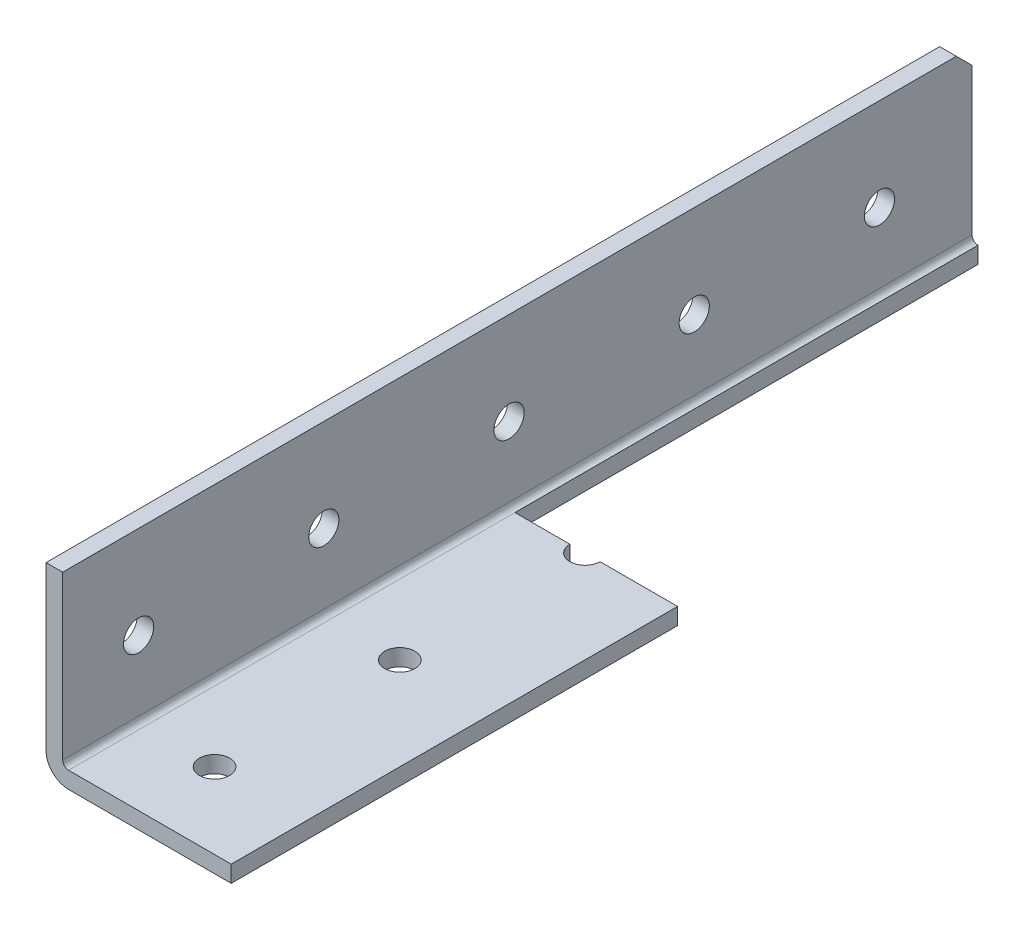
ISO-10303-21;
HEADER;
FILE_DESCRIPTION(('STEP AP214'),'2;1');
FILE_NAME('part.step','',(''),(''),'','','');
FILE_SCHEMA(('AUTOMOTIVE_DESIGN { 1 0 10303 214 1 1 1 1 }'));
ENDSEC;
DATA;
#1=APPLICATION_CONTEXT('core data for automotive mechanical design processes');
#2=APPLICATION_PROTOCOL_DEFINITION('international standard','automotive_design',2000,#1);
#3=PRODUCT_CONTEXT('',#1,'mechanical');
#4=PRODUCT('Part','Part','',(#3));
#5=PRODUCT_RELATED_PRODUCT_CATEGORY('part','',(#4));
#6=PRODUCT_DEFINITION_FORMATION('','',#4);
#7=PRODUCT_DEFINITION_CONTEXT('part definition',#1,'design');
#8=PRODUCT_DEFINITION('design','',#6,#7);
#9=PRODUCT_DEFINITION_SHAPE('','',#8);
#10=(LENGTH_UNIT() NAMED_UNIT(*) SI_UNIT(.MILLI.,.METRE.));
#11=(NAMED_UNIT(*) PLANE_ANGLE_UNIT() SI_UNIT($,.RADIAN.));
#12=(NAMED_UNIT(*) SI_UNIT($,.STERADIAN.) SOLID_ANGLE_UNIT());
#13=UNCERTAINTY_MEASURE_WITH_UNIT(LENGTH_MEASURE(1.E-05),#10,'distance_accuracy_value','');
#14=(GEOMETRIC_REPRESENTATION_CONTEXT(3) GLOBAL_UNCERTAINTY_ASSIGNED_CONTEXT((#13)) GLOBAL_UNIT_ASSIGNED_CONTEXT((#10,
#11,#12)) REPRESENTATION_CONTEXT('',''));
#15=CARTESIAN_POINT('',(0.,0.,0.));
#16=DIRECTION('',(0.,0.,1.));
#17=DIRECTION('',(1.,0.,0.));
#18=AXIS2_PLACEMENT_3D('',#15,#16,#17);
#19=CARTESIAN_POINT('',(25.4,0.,-749.3));
#20=DIRECTION('',(0.,-1.,0.));
#21=DIRECTION('',(0.,0.,-1.));
#22=AXIS2_PLACEMENT_3D('',#19,#20,#21);
#23=PLANE('',#22);
#24=DIRECTION('',(-1.,0.,0.));
#25=VECTOR('',#24,1.);
#26=CARTESIAN_POINT('',(25.4,0.,-685.8));
#27=LINE('',#26,#25);
#28=CARTESIAN_POINT('',(25.4,0.,-685.8));
#29=VERTEX_POINT('',#28);
#30=CARTESIAN_POINT('',(14.7701,0.,-685.8));
#31=VERTEX_POINT('',#30);
#32=EDGE_CURVE('E49',#29,#31,#27,.T.);
#33=ORIENTED_EDGE('',*,*,#32,.F.);
#34=DIRECTION('',(0.,0.,1.));
#35=VECTOR('',#34,1.);
#36=CARTESIAN_POINT('',(25.4,0.,-749.3));
#37=LINE('',#36,#35);
#38=CARTESIAN_POINT('',(25.4,0.,-624.586));
#39=VERTEX_POINT('',#38);
#40=EDGE_CURVE('E185',#29,#39,#37,.T.);
#41=ORIENTED_EDGE('',*,*,#40,.T.);
#42=DIRECTION('',(1.,0.,0.));
#43=VECTOR('',#42,1.);
#44=CARTESIAN_POINT('',(25.4,0.,-624.586));
#45=LINE('',#44,#43);
#46=CARTESIAN_POINT('',(3.0988,0.,-624.586));
#47=VERTEX_POINT('',#46);
#48=EDGE_CURVE('E194',#47,#39,#45,.T.);
#49=ORIENTED_EDGE('',*,*,#48,.F.);
#50=DIRECTION('',(0.,0.,1.));
#51=VECTOR('',#50,1.);
#52=CARTESIAN_POINT('',(3.0988,0.,-749.3));
#53=LINE('',#52,#51);
#54=CARTESIAN_POINT('',(3.0988,0.,-685.8));
#55=VERTEX_POINT('',#54);
#56=EDGE_CURVE('E167',#47,#55,#53,.F.);
#57=ORIENTED_EDGE('',*,*,#56,.T.);
#58=CARTESIAN_POINT('',(10.6299000000001,0.,-685.8));
#59=VERTEX_POINT('',#58);
#60=EDGE_CURVE('E137',#59,#55,#27,.T.);
#61=ORIENTED_EDGE('',*,*,#60,.F.);
#62=CARTESIAN_POINT('',(12.7,0.,-685.8));
#63=DIRECTION('',(0.,-1.,0.));
#64=DIRECTION('',(0.,0.,-1.));
#65=AXIS2_PLACEMENT_3D('',#62,#63,#64);
#66=CIRCLE('',#65,2.07009999999995);
#67=EDGE_CURVE('E243',#31,#59,#66,.T.);
#68=ORIENTED_EDGE('',*,*,#67,.F.);
#69=EDGE_LOOP('',(#33,#41,#49,#57,#61,#68));
#70=FACE_BOUND('',#69,.T.);
#71=CARTESIAN_POINT('',(12.7,0.,-660.4));
#72=DIRECTION('',(0.,-1.,0.));
#73=DIRECTION('',(0.,0.,-1.));
#74=AXIS2_PLACEMENT_3D('',#71,#72,#73);
#75=CIRCLE('',#74,2.07009999999995);
#76=CARTESIAN_POINT('',(12.7,0.,-662.4701));
#77=VERTEX_POINT('',#76);
#78=EDGE_CURVE('E247',#77,#77,#75,.T.);
#79=ORIENTED_EDGE('',*,*,#78,.F.);
#80=EDGE_LOOP('',(#79));
#81=FACE_BOUND('',#80,.T.);
#82=CARTESIAN_POINT('',(12.7,0.,-635.));
#83=DIRECTION('',(0.,-1.,0.));
#84=DIRECTION('',(0.,0.,-1.));
#85=AXIS2_PLACEMENT_3D('',#82,#83,#84);
#86=CIRCLE('',#85,2.07009999999995);
#87=CARTESIAN_POINT('',(12.7,0.,-637.0701));
#88=VERTEX_POINT('',#87);
#89=EDGE_CURVE('E253',#88,#88,#86,.T.);
#90=ORIENTED_EDGE('',*,*,#89,.F.);
#91=EDGE_LOOP('',(#90));
#92=FACE_BOUND('',#91,.T.);
#93=ADVANCED_FACE('F34',(#70,#81,#92),#23,.T.);
#94=CARTESIAN_POINT('',(25.4,25.4,-749.3));
#95=DIRECTION('',(0.,0.,-1.));
#96=DIRECTION('',(-1.,0.,0.));
#97=AXIS2_PLACEMENT_3D('',#94,#95,#96);
#98=PLANE('',#97);
#99=DIRECTION('',(0.,1.,0.));
#100=VECTOR('',#99,1.);
#101=CARTESIAN_POINT('',(3.0988,25.4,-749.3));
#102=LINE('',#101,#100);
#103=CARTESIAN_POINT('',(3.0988,0.,-749.3));
#104=VERTEX_POINT('',#103);
#105=CARTESIAN_POINT('',(3.0988,2.286,-749.3));
#106=VERTEX_POINT('',#105);
#107=EDGE_CURVE('E123',#104,#106,#102,.T.);
#108=ORIENTED_EDGE('',*,*,#107,.F.);
#109=CARTESIAN_POINT('',(3.0988,3.0988,-749.3));
#110=DIRECTION('',(0.,0.,-1.));
#111=DIRECTION('',(-1.,0.,0.));
#112=AXIS2_PLACEMENT_3D('',#109,#110,#111);
#113=CIRCLE('',#112,3.0988);
#114=CARTESIAN_POINT('',(0.,3.0988,-749.3));
#115=VERTEX_POINT('',#114);
#116=EDGE_CURVE('E42',#104,#115,#113,.T.);
#117=ORIENTED_EDGE('',*,*,#116,.T.);
#118=DIRECTION('',(0.,-1.,0.));
#119=VECTOR('',#118,1.);
#120=CARTESIAN_POINT('',(0.,25.4,-749.3));
#121=LINE('',#120,#119);
#122=CARTESIAN_POINT('',(0.,23.241,-749.3));
#123=VERTEX_POINT('',#122);
#124=EDGE_CURVE('E175',#123,#115,#121,.T.);
#125=ORIENTED_EDGE('',*,*,#124,.F.);
#126=DIRECTION('',(1.,0.,0.));
#127=VECTOR('',#126,1.);
#128=CARTESIAN_POINT('',(25.4,23.241,-749.3));
#129=LINE('',#128,#127);
#130=CARTESIAN_POINT('',(2.286,23.241,-749.3));
#131=VERTEX_POINT('',#130);
#132=EDGE_CURVE('E266',#123,#131,#129,.T.);
#133=ORIENTED_EDGE('',*,*,#132,.T.);
#134=DIRECTION('',(0.,1.,0.));
#135=VECTOR('',#134,1.);
#136=CARTESIAN_POINT('',(2.286,2.286,-749.3));
#137=LINE('',#136,#135);
#138=CARTESIAN_POINT('',(2.286,3.0988,-749.3));
#139=VERTEX_POINT('',#138);
#140=EDGE_CURVE('E259',#139,#131,#137,.T.);
#141=ORIENTED_EDGE('',*,*,#140,.F.);
#142=CARTESIAN_POINT('',(3.0988,3.0988,-749.3));
#143=DIRECTION('',(0.,0.,-1.));
#144=DIRECTION('',(-1.,0.,0.));
#145=AXIS2_PLACEMENT_3D('',#142,#143,#144);
#146=CIRCLE('',#145,0.8128);
#147=EDGE_CURVE('E128',#139,#106,#146,.F.);
#148=ORIENTED_EDGE('',*,*,#147,.T.);
#149=EDGE_LOOP('',(#108,#117,#125,#133,#141,#148));
#150=FACE_BOUND('',#149,.T.);
#151=ADVANCED_FACE('F173',(#150),#98,.T.);
#152=CARTESIAN_POINT('',(25.4,25.4,749.3));
#153=DIRECTION('',(0.,1.,0.));
#154=DIRECTION('',(0.,0.,1.));
#155=AXIS2_PLACEMENT_3D('',#152,#153,#154);
#156=PLANE('',#155);
#157=DIRECTION('',(-1.,0.,0.));
#158=VECTOR('',#157,1.);
#159=CARTESIAN_POINT('',(25.4,25.4,-624.586));
#160=LINE('',#159,#158);
#161=CARTESIAN_POINT('',(2.286,25.4,-624.586));
#162=VERTEX_POINT('',#161);
#163=CARTESIAN_POINT('',(0.,25.4000000000002,-624.586));
#164=VERTEX_POINT('',#163);
#165=EDGE_CURVE('E201',#162,#164,#160,.T.);
#166=ORIENTED_EDGE('',*,*,#165,.F.);
#167=DIRECTION('',(0.,0.,-1.));
#168=VECTOR('',#167,1.);
#169=CARTESIAN_POINT('',(2.286,25.4,749.3));
#170=LINE('',#169,#168);
#171=CARTESIAN_POINT('',(2.286,25.4,-747.141));
#172=VERTEX_POINT('',#171);
#173=EDGE_CURVE('E262',#162,#172,#170,.T.);
#174=ORIENTED_EDGE('',*,*,#173,.T.);
#175=DIRECTION('',(-1.,0.,0.));
#176=VECTOR('',#175,1.);
#177=CARTESIAN_POINT('',(25.4,25.4,-747.141));
#178=LINE('',#177,#176);
#179=CARTESIAN_POINT('',(0.,25.4000000000002,-747.140999999999));
#180=VERTEX_POINT('',#179);
#181=EDGE_CURVE('E269',#172,#180,#178,.T.);
#182=ORIENTED_EDGE('',*,*,#181,.T.);
#183=DIRECTION('',(0.,0.,-1.));
#184=VECTOR('',#183,1.);
#185=CARTESIAN_POINT('',(0.,25.4,749.3));
#186=LINE('',#185,#184);
#187=EDGE_CURVE('E186',#164,#180,#186,.T.);
#188=ORIENTED_EDGE('',*,*,#187,.F.);
#189=EDGE_LOOP('',(#166,#174,#182,#188));
#190=FACE_BOUND('',#189,.T.);
#191=ADVANCED_FACE('F284',(#190),#156,.T.);
#192=CARTESIAN_POINT('',(25.4,0.,0.));
#193=DIRECTION('',(-1.,0.,0.));
#194=DIRECTION('',(0.,0.,1.));
#195=AXIS2_PLACEMENT_3D('',#192,#193,#194);
#196=PLANE('',#195);
#197=ORIENTED_EDGE('',*,*,#40,.F.);
#198=DIRECTION('',(0.,1.,0.));
#199=VECTOR('',#198,1.);
#200=CARTESIAN_POINT('',(25.4,0.,-685.8));
#201=LINE('',#200,#199);
#202=CARTESIAN_POINT('',(25.4,2.286,-685.8));
#203=VERTEX_POINT('',#202);
#204=EDGE_CURVE('E289',#29,#203,#201,.T.);
#205=ORIENTED_EDGE('',*,*,#204,.T.);
#206=DIRECTION('',(0.,0.,-1.));
#207=VECTOR('',#206,1.);
#208=CARTESIAN_POINT('',(25.4,2.286,749.3));
#209=LINE('',#208,#207);
#210=CARTESIAN_POINT('',(25.4,2.286,-624.586));
#211=VERTEX_POINT('',#210);
#212=EDGE_CURVE('E261',#211,#203,#209,.T.);
#213=ORIENTED_EDGE('',*,*,#212,.F.);
#214=DIRECTION('',(0.,-1.,0.));
#215=VECTOR('',#214,1.);
#216=CARTESIAN_POINT('',(25.4,0.,-624.586));
#217=LINE('',#216,#215);
#218=EDGE_CURVE('E204',#211,#39,#217,.T.);
#219=ORIENTED_EDGE('',*,*,#218,.T.);
#220=EDGE_LOOP('',(#197,#205,#213,#219));
#221=FACE_BOUND('',#220,.T.);
#222=ADVANCED_FACE('F297',(#221),#196,.F.);
#223=CARTESIAN_POINT('',(0.,0.,0.));
#224=DIRECTION('',(-1.,0.,0.));
#225=DIRECTION('',(0.,0.,1.));
#226=AXIS2_PLACEMENT_3D('',#223,#224,#225);
#227=PLANE('',#226);
#228=DIRECTION('',(0.,-1.,0.));
#229=VECTOR('',#228,1.);
#230=CARTESIAN_POINT('',(0.,0.,-624.586));
#231=LINE('',#230,#229);
#232=CARTESIAN_POINT('',(0.,3.0988,-624.586));
#233=VERTEX_POINT('',#232);
#234=EDGE_CURVE('E196',#164,#233,#231,.T.);
#235=ORIENTED_EDGE('',*,*,#234,.F.);
#236=ORIENTED_EDGE('',*,*,#187,.T.);
#237=DIRECTION('',(0.,0.707106781186511,0.707106781186584));
#238=VECTOR('',#237,1.);
#239=CARTESIAN_POINT('',(0.,386.270500000001,-386.270499999961));
#240=LINE('',#239,#238);
#241=EDGE_CURVE('E184',#180,#123,#240,.F.);
#242=ORIENTED_EDGE('',*,*,#241,.T.);
#243=ORIENTED_EDGE('',*,*,#124,.T.);
#244=DIRECTION('',(0.,0.,1.));
#245=VECTOR('',#244,1.);
#246=CARTESIAN_POINT('',(0.,3.0988,0.));
#247=LINE('',#246,#245);
#248=EDGE_CURVE('E163',#115,#233,#247,.T.);
#249=ORIENTED_EDGE('',*,*,#248,.T.);
#250=EDGE_LOOP('',(#235,#236,#242,#243,#249));
#251=FACE_BOUND('',#250,.T.);
#252=CARTESIAN_POINT('',(0.,12.7,-635.));
#253=DIRECTION('',(-1.,0.,0.));
#254=DIRECTION('',(0.,0.,1.));
#255=AXIS2_PLACEMENT_3D('',#252,#253,#254);
#256=CIRCLE('',#255,2.07009999999995);
#257=CARTESIAN_POINT('',(0.,12.7,-632.9299));
#258=VERTEX_POINT('',#257);
#259=EDGE_CURVE('E213',#258,#258,#256,.T.);
#260=ORIENTED_EDGE('',*,*,#259,.F.);
#261=EDGE_LOOP('',(#260));
#262=FACE_BOUND('',#261,.T.);
#263=CARTESIAN_POINT('',(0.,12.7,-660.4));
#264=DIRECTION('',(-1.,0.,0.));
#265=DIRECTION('',(0.,0.,1.));
#266=AXIS2_PLACEMENT_3D('',#263,#264,#265);
#267=CIRCLE('',#266,2.07009999999995);
#268=CARTESIAN_POINT('',(0.,12.7,-658.3299));
#269=VERTEX_POINT('',#268);
#270=EDGE_CURVE('E219',#269,#269,#267,.T.);
#271=ORIENTED_EDGE('',*,*,#270,.F.);
#272=EDGE_LOOP('',(#271));
#273=FACE_BOUND('',#272,.T.);
#274=CARTESIAN_POINT('',(0.,12.7,-685.8));
#275=DIRECTION('',(-1.,0.,0.));
#276=DIRECTION('',(0.,0.,1.));
#277=AXIS2_PLACEMENT_3D('',#274,#275,#276);
#278=CIRCLE('',#277,2.07009999999995);
#279=CARTESIAN_POINT('',(0.,12.7,-683.7299));
#280=VERTEX_POINT('',#279);
#281=EDGE_CURVE('E225',#280,#280,#278,.T.);
#282=ORIENTED_EDGE('',*,*,#281,.F.);
#283=EDGE_LOOP('',(#282));
#284=FACE_BOUND('',#283,.T.);
#285=CARTESIAN_POINT('',(0.,12.7,-711.2));
#286=DIRECTION('',(-1.,0.,0.));
#287=DIRECTION('',(0.,0.,1.));
#288=AXIS2_PLACEMENT_3D('',#285,#286,#287);
#289=CIRCLE('',#288,2.07009999999995);
#290=CARTESIAN_POINT('',(0.,12.7,-709.1299));
#291=VERTEX_POINT('',#290);
#292=EDGE_CURVE('E231',#291,#291,#289,.T.);
#293=ORIENTED_EDGE('',*,*,#292,.F.);
#294=EDGE_LOOP('',(#293));
#295=FACE_BOUND('',#294,.T.);
#296=CARTESIAN_POINT('',(0.,12.7,-736.6));
#297=DIRECTION('',(-1.,0.,0.));
#298=DIRECTION('',(0.,0.,1.));
#299=AXIS2_PLACEMENT_3D('',#296,#297,#298);
#300=CIRCLE('',#299,2.07009999999995);
#301=CARTESIAN_POINT('',(0.,12.7,-734.5299));
#302=VERTEX_POINT('',#301);
#303=EDGE_CURVE('E237',#302,#302,#300,.T.);
#304=ORIENTED_EDGE('',*,*,#303,.F.);
#305=EDGE_LOOP('',(#304));
#306=FACE_BOUND('',#305,.T.);
#307=ADVANCED_FACE('F181',(#251,#262,#273,#284,#295,#306),#227,.T.);
#308=CARTESIAN_POINT('',(2.286,2.286,749.3));
#309=DIRECTION('',(-1.,0.,0.));
#310=DIRECTION('',(0.,0.,1.));
#311=AXIS2_PLACEMENT_3D('',#308,#309,#310);
#312=PLANE('',#311);
#313=CARTESIAN_POINT('',(2.286,12.7,-635.));
#314=DIRECTION('',(-1.,0.,0.));
#315=DIRECTION('',(0.,0.,1.));
#316=AXIS2_PLACEMENT_3D('',#313,#314,#315);
#317=CIRCLE('',#316,2.07009999999995);
#318=CARTESIAN_POINT('',(2.286,12.7,-632.9299));
#319=VERTEX_POINT('',#318);
#320=EDGE_CURVE('E216',#319,#319,#317,.T.);
#321=ORIENTED_EDGE('',*,*,#320,.T.);
#322=EDGE_LOOP('',(#321));
#323=FACE_BOUND('',#322,.T.);
#324=CARTESIAN_POINT('',(2.286,12.7,-660.4));
#325=DIRECTION('',(-1.,0.,0.));
#326=DIRECTION('',(0.,0.,1.));
#327=AXIS2_PLACEMENT_3D('',#324,#325,#326);
#328=CIRCLE('',#327,2.07009999999995);
#329=CARTESIAN_POINT('',(2.286,12.7,-658.3299));
#330=VERTEX_POINT('',#329);
#331=EDGE_CURVE('E222',#330,#330,#328,.T.);
#332=ORIENTED_EDGE('',*,*,#331,.T.);
#333=EDGE_LOOP('',(#332));
#334=FACE_BOUND('',#333,.T.);
#335=CARTESIAN_POINT('',(2.286,12.7,-685.8));
#336=DIRECTION('',(-1.,0.,0.));
#337=DIRECTION('',(0.,0.,1.));
#338=AXIS2_PLACEMENT_3D('',#335,#336,#337);
#339=CIRCLE('',#338,2.07009999999995);
#340=CARTESIAN_POINT('',(2.286,12.7,-683.7299));
#341=VERTEX_POINT('',#340);
#342=EDGE_CURVE('E228',#341,#341,#339,.T.);
#343=ORIENTED_EDGE('',*,*,#342,.T.);
#344=EDGE_LOOP('',(#343));
#345=FACE_BOUND('',#344,.T.);
#346=CARTESIAN_POINT('',(2.286,12.7,-711.2));
#347=DIRECTION('',(-1.,0.,0.));
#348=DIRECTION('',(0.,0.,1.));
#349=AXIS2_PLACEMENT_3D('',#346,#347,#348);
#350=CIRCLE('',#349,2.07009999999995);
#351=CARTESIAN_POINT('',(2.286,12.7,-709.1299));
#352=VERTEX_POINT('',#351);
#353=EDGE_CURVE('E234',#352,#352,#350,.T.);
#354=ORIENTED_EDGE('',*,*,#353,.T.);
#355=EDGE_LOOP('',(#354));
#356=FACE_BOUND('',#355,.T.);
#357=CARTESIAN_POINT('',(2.286,12.7,-736.6));
#358=DIRECTION('',(-1.,0.,0.));
#359=DIRECTION('',(0.,0.,1.));
#360=AXIS2_PLACEMENT_3D('',#357,#358,#359);
#361=CIRCLE('',#360,2.07009999999995);
#362=CARTESIAN_POINT('',(2.286,12.7,-734.5299));
#363=VERTEX_POINT('',#362);
#364=EDGE_CURVE('E240',#363,#363,#361,.T.);
#365=ORIENTED_EDGE('',*,*,#364,.T.);
#366=EDGE_LOOP('',(#365));
#367=FACE_BOUND('',#366,.T.);
#368=ORIENTED_EDGE('',*,*,#173,.F.);
#369=DIRECTION('',(0.,-1.,0.));
#370=VECTOR('',#369,1.);
#371=CARTESIAN_POINT('',(2.286,2.286,-624.586));
#372=LINE('',#371,#370);
#373=CARTESIAN_POINT('',(2.286,3.0988,-624.586));
#374=VERTEX_POINT('',#373);
#375=EDGE_CURVE('E200',#162,#374,#372,.T.);
#376=ORIENTED_EDGE('',*,*,#375,.T.);
#377=DIRECTION('',(0.,0.,-1.));
#378=VECTOR('',#377,1.);
#379=CARTESIAN_POINT('',(2.286,3.0988,-749.3));
#380=LINE('',#379,#378);
#381=EDGE_CURVE('E157',#374,#139,#380,.T.);
#382=ORIENTED_EDGE('',*,*,#381,.T.);
#383=ORIENTED_EDGE('',*,*,#140,.T.);
#384=DIRECTION('',(0.,-0.707106781186511,-0.707106781186584));
#385=VECTOR('',#384,1.);
#386=CARTESIAN_POINT('',(2.286,25.4,-747.141));
#387=LINE('',#386,#385);
#388=EDGE_CURVE('E158',#131,#172,#387,.F.);
#389=ORIENTED_EDGE('',*,*,#388,.T.);
#390=EDGE_LOOP('',(#368,#376,#382,#383,#389));
#391=FACE_BOUND('',#390,.T.);
#392=ADVANCED_FACE('F277',(#323,#334,#345,#356,#367,#391),#312,.F.);
#393=CARTESIAN_POINT('',(25.4,2.286,749.3));
#394=DIRECTION('',(0.,-1.,0.));
#395=DIRECTION('',(0.,0.,-1.));
#396=AXIS2_PLACEMENT_3D('',#393,#394,#395);
#397=PLANE('',#396);
#398=ORIENTED_EDGE('',*,*,#212,.T.);
#399=DIRECTION('',(1.,0.,0.));
#400=VECTOR('',#399,1.);
#401=CARTESIAN_POINT('',(3.0988,2.286,-685.8));
#402=LINE('',#401,#400);
#403=CARTESIAN_POINT('',(14.7701,2.286,-685.8));
#404=VERTEX_POINT('',#403);
#405=EDGE_CURVE('E151',#404,#203,#402,.T.);
#406=ORIENTED_EDGE('',*,*,#405,.F.);
#407=CARTESIAN_POINT('',(12.7,2.286,-685.8));
#408=DIRECTION('',(0.,-1.,0.));
#409=DIRECTION('',(0.,0.,-1.));
#410=AXIS2_PLACEMENT_3D('',#407,#408,#409);
#411=CIRCLE('',#410,2.07009999999995);
#412=CARTESIAN_POINT('',(10.6299000000001,2.286,-685.8));
#413=VERTEX_POINT('',#412);
#414=EDGE_CURVE('E150',#404,#413,#411,.T.);
#415=ORIENTED_EDGE('',*,*,#414,.T.);
#416=CARTESIAN_POINT('',(3.0988,2.286,-685.8));
#417=VERTEX_POINT('',#416);
#418=EDGE_CURVE('E134',#417,#413,#402,.T.);
#419=ORIENTED_EDGE('',*,*,#418,.F.);
#420=DIRECTION('',(0.,0.,-1.));
#421=VECTOR('',#420,1.);
#422=CARTESIAN_POINT('',(3.0988,2.286,749.3));
#423=LINE('',#422,#421);
#424=CARTESIAN_POINT('',(3.0988,2.286,-624.586));
#425=VERTEX_POINT('',#424);
#426=EDGE_CURVE('E129',#417,#425,#423,.F.);
#427=ORIENTED_EDGE('',*,*,#426,.T.);
#428=DIRECTION('',(1.,0.,0.));
#429=VECTOR('',#428,1.);
#430=CARTESIAN_POINT('',(25.4,2.286,-624.586));
#431=LINE('',#430,#429);
#432=EDGE_CURVE('E211',#425,#211,#431,.T.);
#433=ORIENTED_EDGE('',*,*,#432,.T.);
#434=EDGE_LOOP('',(#398,#406,#415,#419,#427,#433));
#435=FACE_BOUND('',#434,.T.);
#436=CARTESIAN_POINT('',(12.7,2.286,-660.4));
#437=DIRECTION('',(0.,-1.,0.));
#438=DIRECTION('',(0.,0.,-1.));
#439=AXIS2_PLACEMENT_3D('',#436,#437,#438);
#440=CIRCLE('',#439,2.07009999999995);
#441=CARTESIAN_POINT('',(12.7,2.286,-662.4701));
#442=VERTEX_POINT('',#441);
#443=EDGE_CURVE('E250',#442,#442,#440,.T.);
#444=ORIENTED_EDGE('',*,*,#443,.T.);
#445=EDGE_LOOP('',(#444));
#446=FACE_BOUND('',#445,.T.);
#447=CARTESIAN_POINT('',(12.7,2.286,-635.));
#448=DIRECTION('',(0.,-1.,0.));
#449=DIRECTION('',(0.,0.,-1.));
#450=AXIS2_PLACEMENT_3D('',#447,#448,#449);
#451=CIRCLE('',#450,2.07009999999995);
#452=CARTESIAN_POINT('',(12.7,2.286,-637.0701));
#453=VERTEX_POINT('',#452);
#454=EDGE_CURVE('E256',#453,#453,#451,.T.);
#455=ORIENTED_EDGE('',*,*,#454,.T.);
#456=EDGE_LOOP('',(#455));
#457=FACE_BOUND('',#456,.T.);
#458=ADVANCED_FACE('F144',(#435,#446,#457),#397,.F.);
#459=CARTESIAN_POINT('',(12.7,0.,-635.));
#460=DIRECTION('',(0.,-1.,0.));
#461=DIRECTION('',(0.,0.,-1.));
#462=AXIS2_PLACEMENT_3D('',#459,#460,#461);
#463=CYLINDRICAL_SURFACE('',#462,2.07009999999995);
#464=ORIENTED_EDGE('',*,*,#89,.T.);
#465=EDGE_LOOP('',(#464));
#466=FACE_BOUND('',#465,.T.);
#467=ORIENTED_EDGE('',*,*,#454,.F.);
#468=EDGE_LOOP('',(#467));
#469=FACE_BOUND('',#468,.T.);
#470=ADVANCED_FACE('F353',(#466,#469),#463,.F.);
#471=CARTESIAN_POINT('',(12.7,0.,-660.4));
#472=DIRECTION('',(0.,-1.,0.));
#473=DIRECTION('',(0.,0.,-1.));
#474=AXIS2_PLACEMENT_3D('',#471,#472,#473);
#475=CYLINDRICAL_SURFACE('',#474,2.07009999999995);
#476=ORIENTED_EDGE('',*,*,#78,.T.);
#477=EDGE_LOOP('',(#476));
#478=FACE_BOUND('',#477,.T.);
#479=ORIENTED_EDGE('',*,*,#443,.F.);
#480=EDGE_LOOP('',(#479));
#481=FACE_BOUND('',#480,.T.);
#482=ADVANCED_FACE('F350',(#478,#481),#475,.F.);
#483=CARTESIAN_POINT('',(12.7,0.,-685.8));
#484=DIRECTION('',(0.,-1.,0.));
#485=DIRECTION('',(0.,0.,-1.));
#486=AXIS2_PLACEMENT_3D('',#483,#484,#485);
#487=CYLINDRICAL_SURFACE('',#486,2.07009999999995);
#488=ORIENTED_EDGE('',*,*,#67,.T.);
#489=DIRECTION('',(0.,-1.,0.));
#490=VECTOR('',#489,1.);
#491=CARTESIAN_POINT('',(10.6299000000001,0.,-685.8));
#492=LINE('',#491,#490);
#493=EDGE_CURVE('E287',#59,#413,#492,.F.);
#494=ORIENTED_EDGE('',*,*,#493,.T.);
#495=ORIENTED_EDGE('',*,*,#414,.F.);
#496=DIRECTION('',(0.,-1.,0.));
#497=VECTOR('',#496,1.);
#498=CARTESIAN_POINT('',(14.7701,0.,-685.8));
#499=LINE('',#498,#497);
#500=EDGE_CURVE('E139',#404,#31,#499,.T.);
#501=ORIENTED_EDGE('',*,*,#500,.T.);
#502=EDGE_LOOP('',(#488,#494,#495,#501));
#503=FACE_BOUND('',#502,.T.);
#504=ADVANCED_FACE('F295',(#503),#487,.F.);
#505=CARTESIAN_POINT('',(0.,12.7,-736.6));
#506=DIRECTION('',(-1.,0.,0.));
#507=DIRECTION('',(0.,0.,1.));
#508=AXIS2_PLACEMENT_3D('',#505,#506,#507);
#509=CYLINDRICAL_SURFACE('',#508,2.07009999999995);
#510=ORIENTED_EDGE('',*,*,#303,.T.);
#511=EDGE_LOOP('',(#510));
#512=FACE_BOUND('',#511,.T.);
#513=ORIENTED_EDGE('',*,*,#364,.F.);
#514=EDGE_LOOP('',(#513));
#515=FACE_BOUND('',#514,.T.);
#516=ADVANCED_FACE('F344',(#512,#515),#509,.F.);
#517=CARTESIAN_POINT('',(0.,12.7,-711.2));
#518=DIRECTION('',(-1.,0.,0.));
#519=DIRECTION('',(0.,0.,1.));
#520=AXIS2_PLACEMENT_3D('',#517,#518,#519);
#521=CYLINDRICAL_SURFACE('',#520,2.07009999999995);
#522=ORIENTED_EDGE('',*,*,#292,.T.);
#523=EDGE_LOOP('',(#522));
#524=FACE_BOUND('',#523,.T.);
#525=ORIENTED_EDGE('',*,*,#353,.F.);
#526=EDGE_LOOP('',(#525));
#527=FACE_BOUND('',#526,.T.);
#528=ADVANCED_FACE('F340',(#524,#527),#521,.F.);
#529=CARTESIAN_POINT('',(0.,12.7,-685.8));
#530=DIRECTION('',(-1.,0.,0.));
#531=DIRECTION('',(0.,0.,1.));
#532=AXIS2_PLACEMENT_3D('',#529,#530,#531);
#533=CYLINDRICAL_SURFACE('',#532,2.07009999999995);
#534=ORIENTED_EDGE('',*,*,#281,.T.);
#535=EDGE_LOOP('',(#534));
#536=FACE_BOUND('',#535,.T.);
#537=ORIENTED_EDGE('',*,*,#342,.F.);
#538=EDGE_LOOP('',(#537));
#539=FACE_BOUND('',#538,.T.);
#540=ADVANCED_FACE('F336',(#536,#539),#533,.F.);
#541=CARTESIAN_POINT('',(0.,12.7,-660.4));
#542=DIRECTION('',(-1.,0.,0.));
#543=DIRECTION('',(0.,0.,1.));
#544=AXIS2_PLACEMENT_3D('',#541,#542,#543);
#545=CYLINDRICAL_SURFACE('',#544,2.07009999999995);
#546=ORIENTED_EDGE('',*,*,#270,.T.);
#547=EDGE_LOOP('',(#546));
#548=FACE_BOUND('',#547,.T.);
#549=ORIENTED_EDGE('',*,*,#331,.F.);
#550=EDGE_LOOP('',(#549));
#551=FACE_BOUND('',#550,.T.);
#552=ADVANCED_FACE('F332',(#548,#551),#545,.F.);
#553=CARTESIAN_POINT('',(0.,12.7,-635.));
#554=DIRECTION('',(-1.,0.,0.));
#555=DIRECTION('',(0.,0.,1.));
#556=AXIS2_PLACEMENT_3D('',#553,#554,#555);
#557=CYLINDRICAL_SURFACE('',#556,2.07009999999995);
#558=ORIENTED_EDGE('',*,*,#259,.T.);
#559=EDGE_LOOP('',(#558));
#560=FACE_BOUND('',#559,.T.);
#561=ORIENTED_EDGE('',*,*,#320,.F.);
#562=EDGE_LOOP('',(#561));
#563=FACE_BOUND('',#562,.T.);
#564=ADVANCED_FACE('F316',(#560,#563),#557,.F.);
#565=CARTESIAN_POINT('',(25.4,25.4,-747.141));
#566=DIRECTION('',(0.,-0.707106781186584,0.707106781186511));
#567=DIRECTION('',(-1.,0.,0.));
#568=AXIS2_PLACEMENT_3D('',#565,#566,#567);
#569=PLANE('',#568);
#570=ORIENTED_EDGE('',*,*,#388,.F.);
#571=ORIENTED_EDGE('',*,*,#132,.F.);
#572=ORIENTED_EDGE('',*,*,#241,.F.);
#573=ORIENTED_EDGE('',*,*,#181,.F.);
#574=EDGE_LOOP('',(#570,#571,#572,#573));
#575=FACE_BOUND('',#574,.T.);
#576=ADVANCED_FACE('F280',(#575),#569,.F.);
#577=CARTESIAN_POINT('',(3.0988,3.0988,749.3));
#578=DIRECTION('',(0.,0.,1.));
#579=DIRECTION('',(1.,0.,0.));
#580=AXIS2_PLACEMENT_3D('',#577,#578,#579);
#581=CYLINDRICAL_SURFACE('',#580,0.8128);
#582=ORIENTED_EDGE('',*,*,#381,.F.);
#583=CARTESIAN_POINT('',(3.0988,3.0988,-624.586));
#584=DIRECTION('',(0.,0.,-1.));
#585=DIRECTION('',(-1.,0.,0.));
#586=AXIS2_PLACEMENT_3D('',#583,#584,#585);
#587=CIRCLE('',#586,0.8128);
#588=EDGE_CURVE('E156',#374,#425,#587,.F.);
#589=ORIENTED_EDGE('',*,*,#588,.T.);
#590=ORIENTED_EDGE('',*,*,#426,.F.);
#591=EDGE_CURVE('E120',#106,#417,#423,.F.);
#592=ORIENTED_EDGE('',*,*,#591,.F.);
#593=ORIENTED_EDGE('',*,*,#147,.F.);
#594=EDGE_LOOP('',(#582,#589,#590,#592,#593));
#595=FACE_BOUND('',#594,.T.);
#596=ADVANCED_FACE('F155',(#595),#581,.F.);
#597=CARTESIAN_POINT('',(3.0988,3.0988,0.));
#598=DIRECTION('',(0.,0.,1.));
#599=DIRECTION('',(1.,0.,0.));
#600=AXIS2_PLACEMENT_3D('',#597,#598,#599);
#601=CYLINDRICAL_SURFACE('',#600,3.0988);
#602=CARTESIAN_POINT('',(3.0988,3.0988,-624.586));
#603=DIRECTION('',(0.,0.,-1.));
#604=DIRECTION('',(-1.,0.,0.));
#605=AXIS2_PLACEMENT_3D('',#602,#603,#604);
#606=CIRCLE('',#605,3.0988);
#607=EDGE_CURVE('E11',#233,#47,#606,.F.);
#608=ORIENTED_EDGE('',*,*,#607,.F.);
#609=ORIENTED_EDGE('',*,*,#248,.F.);
#610=ORIENTED_EDGE('',*,*,#116,.F.);
#611=EDGE_CURVE('E166',#55,#104,#53,.F.);
#612=ORIENTED_EDGE('',*,*,#611,.F.);
#613=ORIENTED_EDGE('',*,*,#56,.F.);
#614=EDGE_LOOP('',(#608,#609,#610,#612,#613));
#615=FACE_BOUND('',#614,.T.);
#616=ADVANCED_FACE('F36',(#615),#601,.T.);
#617=CARTESIAN_POINT('',(0.,0.,-624.586));
#618=DIRECTION('',(0.,0.,-1.));
#619=DIRECTION('',(-1.,0.,0.));
#620=AXIS2_PLACEMENT_3D('',#617,#618,#619);
#621=PLANE('',#620);
#622=ORIENTED_EDGE('',*,*,#588,.F.);
#623=ORIENTED_EDGE('',*,*,#375,.F.);
#624=ORIENTED_EDGE('',*,*,#165,.T.);
#625=ORIENTED_EDGE('',*,*,#234,.T.);
#626=ORIENTED_EDGE('',*,*,#607,.T.);
#627=ORIENTED_EDGE('',*,*,#48,.T.);
#628=ORIENTED_EDGE('',*,*,#218,.F.);
#629=ORIENTED_EDGE('',*,*,#432,.F.);
#630=EDGE_LOOP('',(#622,#623,#624,#625,#626,#627,#628,#629));
#631=FACE_BOUND('',#630,.T.);
#632=ADVANCED_FACE('F193',(#631),#621,.F.);
#633=CARTESIAN_POINT('',(3.0988,-0.254,-685.8));
#634=DIRECTION('',(-1.,0.,0.));
#635=DIRECTION('',(0.,0.,1.));
#636=AXIS2_PLACEMENT_3D('',#633,#634,#635);
#637=PLANE('',#636);
#638=ORIENTED_EDGE('',*,*,#107,.T.);
#639=ORIENTED_EDGE('',*,*,#591,.T.);
#640=DIRECTION('',(0.,1.,0.));
#641=VECTOR('',#640,1.);
#642=CARTESIAN_POINT('',(3.0988,-0.254,-685.8));
#643=LINE('',#642,#641);
#644=EDGE_CURVE('E57',#55,#417,#643,.T.);
#645=ORIENTED_EDGE('',*,*,#644,.F.);
#646=ORIENTED_EDGE('',*,*,#611,.T.);
#647=EDGE_LOOP('',(#638,#639,#645,#646));
#648=FACE_BOUND('',#647,.T.);
#649=ADVANCED_FACE('F121',(#648),#637,.F.);
#650=CARTESIAN_POINT('',(3.0988,-0.254,-685.8));
#651=DIRECTION('',(0.,0.,1.));
#652=DIRECTION('',(1.,0.,0.));
#653=AXIS2_PLACEMENT_3D('',#650,#651,#652);
#654=PLANE('',#653);
#655=ORIENTED_EDGE('',*,*,#60,.T.);
#656=ORIENTED_EDGE('',*,*,#644,.T.);
#657=ORIENTED_EDGE('',*,*,#418,.T.);
#658=ORIENTED_EDGE('',*,*,#493,.F.);
#659=EDGE_LOOP('',(#655,#656,#657,#658));
#660=FACE_BOUND('',#659,.T.);
#661=ADVANCED_FACE('F133',(#660),#654,.F.);
#662=ORIENTED_EDGE('',*,*,#32,.T.);
#663=ORIENTED_EDGE('',*,*,#500,.F.);
#664=ORIENTED_EDGE('',*,*,#405,.T.);
#665=ORIENTED_EDGE('',*,*,#204,.F.);
#666=EDGE_LOOP('',(#662,#663,#664,#665));
#667=FACE_BOUND('',#666,.T.);
#668=ADVANCED_FACE('F299',(#667),#654,.F.);
#669=CLOSED_SHELL('',(#93,#151,#191,#222,#307,#392,#458,#470,#482,#504,#516,#528,#540,#552,#564,
#576,#596,#616,#632,#649,#661,#668));
#670=MANIFOLD_SOLID_BREP('B2',#669);
#671=ADVANCED_BREP_SHAPE_REPRESENTATION('',(#18,#670),#14);
#672=SHAPE_DEFINITION_REPRESENTATION(#9,#671);
ENDSEC;
END-ISO-10303-21;
